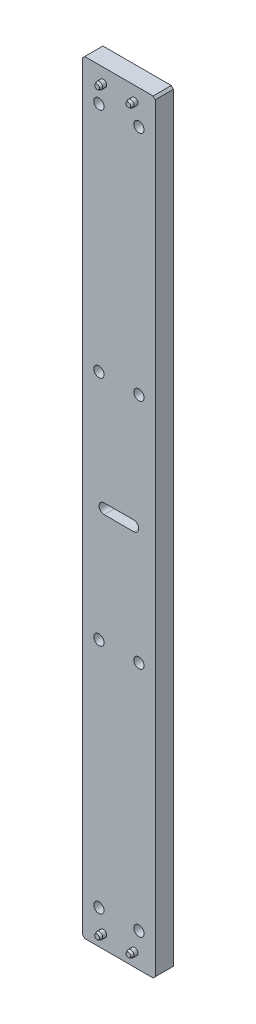
ISO-10303-21;
HEADER;
FILE_DESCRIPTION(('STEP AP214'),'2;1');
FILE_NAME('part.step','',(''),(''),'','','');
FILE_SCHEMA(('AUTOMOTIVE_DESIGN { 1 0 10303 214 1 1 1 1 }'));
ENDSEC;
DATA;
#1=APPLICATION_CONTEXT('core data for automotive mechanical design processes');
#2=APPLICATION_PROTOCOL_DEFINITION('international standard','automotive_design',2000,#1);
#3=PRODUCT_CONTEXT('',#1,'mechanical');
#4=PRODUCT('Part','Part','',(#3));
#5=PRODUCT_RELATED_PRODUCT_CATEGORY('part','',(#4));
#6=PRODUCT_DEFINITION_FORMATION('','',#4);
#7=PRODUCT_DEFINITION_CONTEXT('part definition',#1,'design');
#8=PRODUCT_DEFINITION('design','',#6,#7);
#9=PRODUCT_DEFINITION_SHAPE('','',#8);
#10=(LENGTH_UNIT() NAMED_UNIT(*) SI_UNIT(.MILLI.,.METRE.));
#11=(NAMED_UNIT(*) PLANE_ANGLE_UNIT() SI_UNIT($,.RADIAN.));
#12=(NAMED_UNIT(*) SI_UNIT($,.STERADIAN.) SOLID_ANGLE_UNIT());
#13=UNCERTAINTY_MEASURE_WITH_UNIT(LENGTH_MEASURE(1.E-05),#10,'distance_accuracy_value','');
#14=(GEOMETRIC_REPRESENTATION_CONTEXT(3) GLOBAL_UNCERTAINTY_ASSIGNED_CONTEXT((#13)) GLOBAL_UNIT_ASSIGNED_CONTEXT((#10,
#11,#12)) REPRESENTATION_CONTEXT('',''));
#15=CARTESIAN_POINT('',(0.,0.,0.));
#16=DIRECTION('',(0.,0.,1.));
#17=DIRECTION('',(1.,0.,0.));
#18=AXIS2_PLACEMENT_3D('',#15,#16,#17);
#19=CARTESIAN_POINT('',(10.922,-257.048,-5.20700000000002));
#20=DIRECTION('',(0.,0.,1.));
#21=DIRECTION('',(-1.,0.,0.));
#22=AXIS2_PLACEMENT_3D('',#19,#20,#21);
#23=PLANE('',#22);
#24=CARTESIAN_POINT('',(10.922,-257.048,-5.20700000000002));
#25=DIRECTION('',(0.,0.,1.));
#26=DIRECTION('',(-1.,0.,0.));
#27=AXIS2_PLACEMENT_3D('',#24,#25,#26);
#28=CIRCLE('',#27,2.1209);
#29=CARTESIAN_POINT('',(8.80109999999999,-257.048,-5.20700000000002));
#30=VERTEX_POINT('',#29);
#31=EDGE_CURVE('E57',#30,#30,#28,.T.);
#32=ORIENTED_EDGE('',*,*,#31,.F.);
#33=EDGE_LOOP('',(#32));
#34=FACE_BOUND('',#33,.T.);
#35=ADVANCED_FACE('F43',(#34),#23,.F.);
#36=CARTESIAN_POINT('',(10.922,-257.048,10.668));
#37=DIRECTION('',(0.,0.,-1.));
#38=DIRECTION('',(1.,0.,0.));
#39=AXIS2_PLACEMENT_3D('',#36,#37,#38);
#40=PLANE('',#39);
#41=CARTESIAN_POINT('',(10.922,-257.048,10.668));
#42=DIRECTION('',(0.,0.,1.));
#43=DIRECTION('',(-1.,0.,0.));
#44=AXIS2_PLACEMENT_3D('',#41,#42,#43);
#45=CIRCLE('',#44,1.64944869993752);
#46=CARTESIAN_POINT('',(9.27255130006246,-257.048,10.668));
#47=VERTEX_POINT('',#46);
#48=EDGE_CURVE('E11',#47,#47,#45,.T.);
#49=ORIENTED_EDGE('',*,*,#48,.T.);
#50=EDGE_LOOP('',(#49));
#51=FACE_BOUND('',#50,.T.);
#52=ADVANCED_FACE('F66',(#51),#40,.F.);
#53=CARTESIAN_POINT('',(10.922,-257.048,9.0932));
#54=DIRECTION('',(0.,0.,-1.));
#55=DIRECTION('',(1.,0.,0.));
#56=AXIS2_PLACEMENT_3D('',#53,#54,#55);
#57=CONICAL_SURFACE('',#56,2.38379,0.436332312998575);
#58=ORIENTED_EDGE('',*,*,#48,.F.);
#59=EDGE_LOOP('',(#58));
#60=FACE_BOUND('',#59,.T.);
#61=CARTESIAN_POINT('',(10.922,-257.048,9.0932));
#62=DIRECTION('',(0.,0.,1.));
#63=DIRECTION('',(-1.,0.,0.));
#64=AXIS2_PLACEMENT_3D('',#61,#62,#63);
#65=CIRCLE('',#64,2.38379);
#66=CARTESIAN_POINT('',(8.53820999999999,-257.048,9.0932));
#67=VERTEX_POINT('',#66);
#68=EDGE_CURVE('E49',#67,#67,#65,.T.);
#69=ORIENTED_EDGE('',*,*,#68,.T.);
#70=EDGE_LOOP('',(#69));
#71=FACE_BOUND('',#70,.T.);
#72=ADVANCED_FACE('F70',(#60,#71),#57,.T.);
#73=CARTESIAN_POINT('',(10.922,-257.048,-5.20700000000002));
#74=DIRECTION('',(0.,0.,1.));
#75=DIRECTION('',(-1.,0.,0.));
#76=AXIS2_PLACEMENT_3D('',#73,#74,#75);
#77=CYLINDRICAL_SURFACE('',#76,2.38379);
#78=ORIENTED_EDGE('',*,*,#68,.F.);
#79=EDGE_LOOP('',(#78));
#80=FACE_BOUND('',#79,.T.);
#81=CARTESIAN_POINT('',(10.922,-257.048,-1.44749784777304));
#82=DIRECTION('',(0.,0.,1.));
#83=DIRECTION('',(-1.,0.,0.));
#84=AXIS2_PLACEMENT_3D('',#81,#82,#83);
#85=CIRCLE('',#84,2.38379);
#86=CARTESIAN_POINT('',(8.53820999999999,-257.048,-1.44749784777304));
#87=VERTEX_POINT('',#86);
#88=EDGE_CURVE('E53',#87,#87,#85,.T.);
#89=ORIENTED_EDGE('',*,*,#88,.T.);
#90=EDGE_LOOP('',(#89));
#91=FACE_BOUND('',#90,.T.);
#92=ADVANCED_FACE('F74',(#80,#91),#77,.T.);
#93=CARTESIAN_POINT('',(10.922,-257.048,-5.20700000000002));
#94=DIRECTION('',(0.,0.,1.));
#95=DIRECTION('',(-1.,0.,0.));
#96=AXIS2_PLACEMENT_3D('',#93,#94,#95);
#97=CONICAL_SURFACE('',#96,2.1209,0.0698131700797735);
#98=ORIENTED_EDGE('',*,*,#88,.F.);
#99=EDGE_LOOP('',(#98));
#100=FACE_BOUND('',#99,.T.);
#101=ORIENTED_EDGE('',*,*,#31,.T.);
#102=EDGE_LOOP('',(#101));
#103=FACE_BOUND('',#102,.T.);
#104=ADVANCED_FACE('F63',(#100,#103),#97,.T.);
#105=CLOSED_SHELL('',(#35,#52,#72,#92,#104));
#106=MANIFOLD_SOLID_BREP('B2',#105);
#107=CARTESIAN_POINT('',(-10.9219999999999,-257.048,-5.20700000000005));
#108=DIRECTION('',(0.,0.,1.));
#109=DIRECTION('',(-1.,0.,0.));
#110=AXIS2_PLACEMENT_3D('',#107,#108,#109);
#111=PLANE('',#110);
#112=CARTESIAN_POINT('',(-10.9219999999999,-257.048,-5.20700000000005));
#113=DIRECTION('',(0.,0.,1.));
#114=DIRECTION('',(-1.,0.,0.));
#115=AXIS2_PLACEMENT_3D('',#112,#113,#114);
#116=CIRCLE('',#115,2.1209);
#117=CARTESIAN_POINT('',(-13.0428999999999,-257.048,-5.20700000000005));
#118=VERTEX_POINT('',#117);
#119=EDGE_CURVE('E135',#118,#118,#116,.T.);
#120=ORIENTED_EDGE('',*,*,#119,.F.);
#121=EDGE_LOOP('',(#120));
#122=FACE_BOUND('',#121,.T.);
#123=ADVANCED_FACE('F121',(#122),#111,.F.);
#124=CARTESIAN_POINT('',(-10.9219999999999,-257.048,10.668));
#125=DIRECTION('',(0.,0.,-1.));
#126=DIRECTION('',(1.,0.,0.));
#127=AXIS2_PLACEMENT_3D('',#124,#125,#126);
#128=PLANE('',#127);
#129=CARTESIAN_POINT('',(-10.9219999999999,-257.048,10.668));
#130=DIRECTION('',(0.,0.,1.));
#131=DIRECTION('',(-1.,0.,0.));
#132=AXIS2_PLACEMENT_3D('',#129,#130,#131);
#133=CIRCLE('',#132,1.64944869993752);
#134=CARTESIAN_POINT('',(-12.5714486999374,-257.048,10.668));
#135=VERTEX_POINT('',#134);
#136=EDGE_CURVE('E42',#135,#135,#133,.T.);
#137=ORIENTED_EDGE('',*,*,#136,.T.);
#138=EDGE_LOOP('',(#137));
#139=FACE_BOUND('',#138,.T.);
#140=ADVANCED_FACE('F144',(#139),#128,.F.);
#141=CARTESIAN_POINT('',(-10.9219999999999,-257.048,9.09319999999997));
#142=DIRECTION('',(0.,0.,-1.));
#143=DIRECTION('',(1.,0.,0.));
#144=AXIS2_PLACEMENT_3D('',#141,#142,#143);
#145=CONICAL_SURFACE('',#144,2.38379,0.436332312998575);
#146=ORIENTED_EDGE('',*,*,#136,.F.);
#147=EDGE_LOOP('',(#146));
#148=FACE_BOUND('',#147,.T.);
#149=CARTESIAN_POINT('',(-10.9219999999999,-257.048,9.09319999999997));
#150=DIRECTION('',(0.,0.,1.));
#151=DIRECTION('',(-1.,0.,0.));
#152=AXIS2_PLACEMENT_3D('',#149,#150,#151);
#153=CIRCLE('',#152,2.38379);
#154=CARTESIAN_POINT('',(-13.3057899999999,-257.048,9.09319999999997));
#155=VERTEX_POINT('',#154);
#156=EDGE_CURVE('E127',#155,#155,#153,.T.);
#157=ORIENTED_EDGE('',*,*,#156,.T.);
#158=EDGE_LOOP('',(#157));
#159=FACE_BOUND('',#158,.T.);
#160=ADVANCED_FACE('F148',(#148,#159),#145,.T.);
#161=CARTESIAN_POINT('',(-10.9219999999999,-257.048,-5.20700000000005));
#162=DIRECTION('',(0.,0.,1.));
#163=DIRECTION('',(-1.,0.,0.));
#164=AXIS2_PLACEMENT_3D('',#161,#162,#163);
#165=CYLINDRICAL_SURFACE('',#164,2.38379);
#166=ORIENTED_EDGE('',*,*,#156,.F.);
#167=EDGE_LOOP('',(#166));
#168=FACE_BOUND('',#167,.T.);
#169=CARTESIAN_POINT('',(-10.9219999999999,-257.048,-1.44749784777307));
#170=DIRECTION('',(0.,0.,1.));
#171=DIRECTION('',(-1.,0.,0.));
#172=AXIS2_PLACEMENT_3D('',#169,#170,#171);
#173=CIRCLE('',#172,2.38379);
#174=CARTESIAN_POINT('',(-13.3057899999999,-257.048,-1.44749784777307));
#175=VERTEX_POINT('',#174);
#176=EDGE_CURVE('E131',#175,#175,#173,.T.);
#177=ORIENTED_EDGE('',*,*,#176,.T.);
#178=EDGE_LOOP('',(#177));
#179=FACE_BOUND('',#178,.T.);
#180=ADVANCED_FACE('F152',(#168,#179),#165,.T.);
#181=CARTESIAN_POINT('',(-10.9219999999999,-257.048,-5.20700000000005));
#182=DIRECTION('',(0.,0.,1.));
#183=DIRECTION('',(-1.,0.,0.));
#184=AXIS2_PLACEMENT_3D('',#181,#182,#183);
#185=CONICAL_SURFACE('',#184,2.1209,0.0698131700797735);
#186=ORIENTED_EDGE('',*,*,#176,.F.);
#187=EDGE_LOOP('',(#186));
#188=FACE_BOUND('',#187,.T.);
#189=ORIENTED_EDGE('',*,*,#119,.T.);
#190=EDGE_LOOP('',(#189));
#191=FACE_BOUND('',#190,.T.);
#192=ADVANCED_FACE('F141',(#188,#191),#185,.T.);
#193=CLOSED_SHELL('',(#123,#140,#160,#180,#192));
#194=MANIFOLD_SOLID_BREP('B6',#193);
#195=CARTESIAN_POINT('',(10.9219999999999,257.048,-5.20700000000002));
#196=DIRECTION('',(0.,0.,1.));
#197=DIRECTION('',(-1.,0.,0.));
#198=AXIS2_PLACEMENT_3D('',#195,#196,#197);
#199=PLANE('',#198);
#200=CARTESIAN_POINT('',(10.9219999999999,257.048,-5.20700000000002));
#201=DIRECTION('',(0.,0.,1.));
#202=DIRECTION('',(-1.,0.,0.));
#203=AXIS2_PLACEMENT_3D('',#200,#201,#202);
#204=CIRCLE('',#203,2.1209);
#205=CARTESIAN_POINT('',(8.80109999999987,257.048,-5.20700000000002));
#206=VERTEX_POINT('',#205);
#207=EDGE_CURVE('E213',#206,#206,#204,.T.);
#208=ORIENTED_EDGE('',*,*,#207,.F.);
#209=EDGE_LOOP('',(#208));
#210=FACE_BOUND('',#209,.T.);
#211=ADVANCED_FACE('F199',(#210),#199,.F.);
#212=CARTESIAN_POINT('',(10.9219999999999,257.048,10.668));
#213=DIRECTION('',(0.,0.,-1.));
#214=DIRECTION('',(1.,0.,0.));
#215=AXIS2_PLACEMENT_3D('',#212,#213,#214);
#216=PLANE('',#215);
#217=CARTESIAN_POINT('',(10.9219999999999,257.048,10.668));
#218=DIRECTION('',(0.,0.,1.));
#219=DIRECTION('',(-1.,0.,0.));
#220=AXIS2_PLACEMENT_3D('',#217,#218,#219);
#221=CIRCLE('',#220,1.64944869993752);
#222=CARTESIAN_POINT('',(9.27255130006235,257.048,10.668));
#223=VERTEX_POINT('',#222);
#224=EDGE_CURVE('E120',#223,#223,#221,.T.);
#225=ORIENTED_EDGE('',*,*,#224,.T.);
#226=EDGE_LOOP('',(#225));
#227=FACE_BOUND('',#226,.T.);
#228=ADVANCED_FACE('F222',(#227),#216,.F.);
#229=CARTESIAN_POINT('',(10.9219999999999,257.048,9.0932));
#230=DIRECTION('',(0.,0.,-1.));
#231=DIRECTION('',(1.,0.,0.));
#232=AXIS2_PLACEMENT_3D('',#229,#230,#231);
#233=CONICAL_SURFACE('',#232,2.38379,0.436332312998575);
#234=ORIENTED_EDGE('',*,*,#224,.F.);
#235=EDGE_LOOP('',(#234));
#236=FACE_BOUND('',#235,.T.);
#237=CARTESIAN_POINT('',(10.9219999999999,257.048,9.0932));
#238=DIRECTION('',(0.,0.,1.));
#239=DIRECTION('',(-1.,0.,0.));
#240=AXIS2_PLACEMENT_3D('',#237,#238,#239);
#241=CIRCLE('',#240,2.38379);
#242=CARTESIAN_POINT('',(8.53820999999988,257.048,9.0932));
#243=VERTEX_POINT('',#242);
#244=EDGE_CURVE('E205',#243,#243,#241,.T.);
#245=ORIENTED_EDGE('',*,*,#244,.T.);
#246=EDGE_LOOP('',(#245));
#247=FACE_BOUND('',#246,.T.);
#248=ADVANCED_FACE('F226',(#236,#247),#233,.T.);
#249=CARTESIAN_POINT('',(10.9219999999999,257.048,-5.20700000000002));
#250=DIRECTION('',(0.,0.,1.));
#251=DIRECTION('',(-1.,0.,0.));
#252=AXIS2_PLACEMENT_3D('',#249,#250,#251);
#253=CYLINDRICAL_SURFACE('',#252,2.38379);
#254=ORIENTED_EDGE('',*,*,#244,.F.);
#255=EDGE_LOOP('',(#254));
#256=FACE_BOUND('',#255,.T.);
#257=CARTESIAN_POINT('',(10.9219999999999,257.048,-1.44749784777304));
#258=DIRECTION('',(0.,0.,1.));
#259=DIRECTION('',(-1.,0.,0.));
#260=AXIS2_PLACEMENT_3D('',#257,#258,#259);
#261=CIRCLE('',#260,2.38379);
#262=CARTESIAN_POINT('',(8.53820999999987,257.048,-1.44749784777304));
#263=VERTEX_POINT('',#262);
#264=EDGE_CURVE('E209',#263,#263,#261,.T.);
#265=ORIENTED_EDGE('',*,*,#264,.T.);
#266=EDGE_LOOP('',(#265));
#267=FACE_BOUND('',#266,.T.);
#268=ADVANCED_FACE('F230',(#256,#267),#253,.T.);
#269=CARTESIAN_POINT('',(10.9219999999999,257.048,-5.20700000000002));
#270=DIRECTION('',(0.,0.,1.));
#271=DIRECTION('',(-1.,0.,0.));
#272=AXIS2_PLACEMENT_3D('',#269,#270,#271);
#273=CONICAL_SURFACE('',#272,2.1209,0.0698131700797735);
#274=ORIENTED_EDGE('',*,*,#264,.F.);
#275=EDGE_LOOP('',(#274));
#276=FACE_BOUND('',#275,.T.);
#277=ORIENTED_EDGE('',*,*,#207,.T.);
#278=EDGE_LOOP('',(#277));
#279=FACE_BOUND('',#278,.T.);
#280=ADVANCED_FACE('F219',(#276,#279),#273,.T.);
#281=CLOSED_SHELL('',(#211,#228,#248,#268,#280));
#282=MANIFOLD_SOLID_BREP('B37',#281);
#283=CARTESIAN_POINT('',(-10.922,257.048,-5.20700000000002));
#284=DIRECTION('',(0.,0.,1.));
#285=DIRECTION('',(-1.,0.,0.));
#286=AXIS2_PLACEMENT_3D('',#283,#284,#285);
#287=PLANE('',#286);
#288=CARTESIAN_POINT('',(-10.922,257.048,-5.20700000000002));
#289=DIRECTION('',(0.,0.,1.));
#290=DIRECTION('',(-1.,0.,0.));
#291=AXIS2_PLACEMENT_3D('',#288,#289,#290);
#292=CIRCLE('',#291,2.1209);
#293=CARTESIAN_POINT('',(-13.0429,257.048,-5.20700000000002));
#294=VERTEX_POINT('',#293);
#295=EDGE_CURVE('E292',#294,#294,#292,.T.);
#296=ORIENTED_EDGE('',*,*,#295,.F.);
#297=EDGE_LOOP('',(#296));
#298=FACE_BOUND('',#297,.T.);
#299=ADVANCED_FACE('F278',(#298),#287,.F.);
#300=CARTESIAN_POINT('',(-10.922,257.048,10.668));
#301=DIRECTION('',(0.,0.,-1.));
#302=DIRECTION('',(1.,0.,0.));
#303=AXIS2_PLACEMENT_3D('',#300,#301,#302);
#304=PLANE('',#303);
#305=CARTESIAN_POINT('',(-10.922,257.048,10.668));
#306=DIRECTION('',(0.,0.,1.));
#307=DIRECTION('',(-1.,0.,0.));
#308=AXIS2_PLACEMENT_3D('',#305,#306,#307);
#309=CIRCLE('',#308,1.64944869993752);
#310=CARTESIAN_POINT('',(-12.5714486999375,257.048,10.668));
#311=VERTEX_POINT('',#310);
#312=EDGE_CURVE('E198',#311,#311,#309,.T.);
#313=ORIENTED_EDGE('',*,*,#312,.T.);
#314=EDGE_LOOP('',(#313));
#315=FACE_BOUND('',#314,.T.);
#316=ADVANCED_FACE('F301',(#315),#304,.F.);
#317=CARTESIAN_POINT('',(-10.922,257.048,9.0932));
#318=DIRECTION('',(0.,0.,-1.));
#319=DIRECTION('',(1.,0.,0.));
#320=AXIS2_PLACEMENT_3D('',#317,#318,#319);
#321=CONICAL_SURFACE('',#320,2.38379,0.436332312998575);
#322=ORIENTED_EDGE('',*,*,#312,.F.);
#323=EDGE_LOOP('',(#322));
#324=FACE_BOUND('',#323,.T.);
#325=CARTESIAN_POINT('',(-10.922,257.048,9.0932));
#326=DIRECTION('',(0.,0.,1.));
#327=DIRECTION('',(-1.,0.,0.));
#328=AXIS2_PLACEMENT_3D('',#325,#326,#327);
#329=CIRCLE('',#328,2.38379);
#330=CARTESIAN_POINT('',(-13.30579,257.048,9.0932));
#331=VERTEX_POINT('',#330);
#332=EDGE_CURVE('E284',#331,#331,#329,.T.);
#333=ORIENTED_EDGE('',*,*,#332,.T.);
#334=EDGE_LOOP('',(#333));
#335=FACE_BOUND('',#334,.T.);
#336=ADVANCED_FACE('F305',(#324,#335),#321,.T.);
#337=CARTESIAN_POINT('',(-10.922,257.048,-5.20700000000002));
#338=DIRECTION('',(0.,0.,1.));
#339=DIRECTION('',(-1.,0.,0.));
#340=AXIS2_PLACEMENT_3D('',#337,#338,#339);
#341=CYLINDRICAL_SURFACE('',#340,2.38379);
#342=ORIENTED_EDGE('',*,*,#332,.F.);
#343=EDGE_LOOP('',(#342));
#344=FACE_BOUND('',#343,.T.);
#345=CARTESIAN_POINT('',(-10.922,257.048,-1.44749784777304));
#346=DIRECTION('',(0.,0.,1.));
#347=DIRECTION('',(-1.,0.,0.));
#348=AXIS2_PLACEMENT_3D('',#345,#346,#347);
#349=CIRCLE('',#348,2.38379);
#350=CARTESIAN_POINT('',(-13.30579,257.048,-1.44749784777304));
#351=VERTEX_POINT('',#350);
#352=EDGE_CURVE('E288',#351,#351,#349,.T.);
#353=ORIENTED_EDGE('',*,*,#352,.T.);
#354=EDGE_LOOP('',(#353));
#355=FACE_BOUND('',#354,.T.);
#356=ADVANCED_FACE('F309',(#344,#355),#341,.T.);
#357=CARTESIAN_POINT('',(-10.922,257.048,-5.20700000000002));
#358=DIRECTION('',(0.,0.,1.));
#359=DIRECTION('',(-1.,0.,0.));
#360=AXIS2_PLACEMENT_3D('',#357,#358,#359);
#361=CONICAL_SURFACE('',#360,2.1209,0.0698131700797735);
#362=ORIENTED_EDGE('',*,*,#352,.F.);
#363=EDGE_LOOP('',(#362));
#364=FACE_BOUND('',#363,.T.);
#365=ORIENTED_EDGE('',*,*,#295,.T.);
#366=EDGE_LOOP('',(#365));
#367=FACE_BOUND('',#366,.T.);
#368=ADVANCED_FACE('F298',(#364,#367),#361,.T.);
#369=CLOSED_SHELL('',(#299,#316,#336,#356,#368));
#370=MANIFOLD_SOLID_BREP('B115',#369);
#371=CARTESIAN_POINT('',(25.3999999999999,266.7,-6.35));
#372=DIRECTION('',(1.,0.,0.));
#373=DIRECTION('',(0.,0.,-1.));
#374=AXIS2_PLACEMENT_3D('',#371,#372,#373);
#375=PLANE('',#374);
#376=DIRECTION('',(0.,1.,0.));
#377=VECTOR('',#376,1.);
#378=CARTESIAN_POINT('',(25.3999999999999,266.7,6.35));
#379=LINE('',#378,#377);
#380=CARTESIAN_POINT('',(25.3999999999999,-265.176,6.35));
#381=VERTEX_POINT('',#380);
#382=CARTESIAN_POINT('',(25.3999999999999,265.176,6.35));
#383=VERTEX_POINT('',#382);
#384=EDGE_CURVE('E480',#381,#383,#379,.T.);
#385=ORIENTED_EDGE('',*,*,#384,.F.);
#386=DIRECTION('',(0.,0.,-1.));
#387=VECTOR('',#386,1.);
#388=CARTESIAN_POINT('',(25.3999999999999,-265.176,-6.35));
#389=LINE('',#388,#387);
#390=CARTESIAN_POINT('',(25.3999999999999,-265.176,-6.35));
#391=VERTEX_POINT('',#390);
#392=EDGE_CURVE('E534',#381,#391,#389,.T.);
#393=ORIENTED_EDGE('',*,*,#392,.T.);
#394=DIRECTION('',(0.,1.,0.));
#395=VECTOR('',#394,1.);
#396=CARTESIAN_POINT('',(25.3999999999999,266.7,-6.35));
#397=LINE('',#396,#395);
#398=CARTESIAN_POINT('',(25.3999999999999,265.176,-6.35));
#399=VERTEX_POINT('',#398);
#400=EDGE_CURVE('E484',#391,#399,#397,.T.);
#401=ORIENTED_EDGE('',*,*,#400,.T.);
#402=DIRECTION('',(0.,0.,1.));
#403=VECTOR('',#402,1.);
#404=CARTESIAN_POINT('',(25.3999999999999,265.176,-6.35));
#405=LINE('',#404,#403);
#406=EDGE_CURVE('E531',#399,#383,#405,.T.);
#407=ORIENTED_EDGE('',*,*,#406,.T.);
#408=EDGE_LOOP('',(#385,#393,#401,#407));
#409=FACE_BOUND('',#408,.T.);
#410=ADVANCED_FACE('F348',(#409),#375,.T.);
#411=CARTESIAN_POINT('',(25.3999999999999,-266.7,-6.35));
#412=DIRECTION('',(0.,-1.,0.));
#413=DIRECTION('',(0.,0.,-1.));
#414=AXIS2_PLACEMENT_3D('',#411,#412,#413);
#415=PLANE('',#414);
#416=DIRECTION('',(1.,0.,0.));
#417=VECTOR('',#416,1.);
#418=CARTESIAN_POINT('',(25.3999999999999,-266.7,6.35));
#419=LINE('',#418,#417);
#420=CARTESIAN_POINT('',(-23.8759999999998,-266.7,6.35));
#421=VERTEX_POINT('',#420);
#422=CARTESIAN_POINT('',(23.8759999999998,-266.7,6.35));
#423=VERTEX_POINT('',#422);
#424=EDGE_CURVE('E488',#421,#423,#419,.T.);
#425=ORIENTED_EDGE('',*,*,#424,.F.);
#426=DIRECTION('',(0.,0.,-1.));
#427=VECTOR('',#426,1.);
#428=CARTESIAN_POINT('',(-23.8759999999998,-266.7,-6.35));
#429=LINE('',#428,#427);
#430=CARTESIAN_POINT('',(-23.8759999999997,-266.7,-6.35));
#431=VERTEX_POINT('',#430);
#432=EDGE_CURVE('E522',#421,#431,#429,.T.);
#433=ORIENTED_EDGE('',*,*,#432,.T.);
#434=DIRECTION('',(1.,0.,0.));
#435=VECTOR('',#434,1.);
#436=CARTESIAN_POINT('',(25.3999999999999,-266.7,-6.35));
#437=LINE('',#436,#435);
#438=CARTESIAN_POINT('',(23.8759999999998,-266.7,-6.35));
#439=VERTEX_POINT('',#438);
#440=EDGE_CURVE('E493',#431,#439,#437,.T.);
#441=ORIENTED_EDGE('',*,*,#440,.T.);
#442=DIRECTION('',(0.,0.,1.));
#443=VECTOR('',#442,1.);
#444=CARTESIAN_POINT('',(23.8759999999998,-266.7,-6.35));
#445=LINE('',#444,#443);
#446=EDGE_CURVE('E519',#439,#423,#445,.T.);
#447=ORIENTED_EDGE('',*,*,#446,.T.);
#448=EDGE_LOOP('',(#425,#433,#441,#447));
#449=FACE_BOUND('',#448,.T.);
#450=ADVANCED_FACE('F548',(#449),#415,.T.);
#451=CARTESIAN_POINT('',(-25.4,266.7,-6.35));
#452=DIRECTION('',(-1.,0.,0.));
#453=DIRECTION('',(0.,0.,1.));
#454=AXIS2_PLACEMENT_3D('',#451,#452,#453);
#455=PLANE('',#454);
#456=DIRECTION('',(0.,-1.,0.));
#457=VECTOR('',#456,1.);
#458=CARTESIAN_POINT('',(-25.4,266.7,-6.35));
#459=LINE('',#458,#457);
#460=CARTESIAN_POINT('',(-25.3999999999999,265.176,-6.35));
#461=VERTEX_POINT('',#460);
#462=CARTESIAN_POINT('',(-25.4,-265.176,-6.35));
#463=VERTEX_POINT('',#462);
#464=EDGE_CURVE('E490',#461,#463,#459,.T.);
#465=ORIENTED_EDGE('',*,*,#464,.T.);
#466=DIRECTION('',(0.,0.,1.));
#467=VECTOR('',#466,1.);
#468=CARTESIAN_POINT('',(-25.4,-265.176,-6.35));
#469=LINE('',#468,#467);
#470=CARTESIAN_POINT('',(-25.4,-265.176,6.35));
#471=VERTEX_POINT('',#470);
#472=EDGE_CURVE('E508',#463,#471,#469,.T.);
#473=ORIENTED_EDGE('',*,*,#472,.T.);
#474=DIRECTION('',(0.,-1.,0.));
#475=VECTOR('',#474,1.);
#476=CARTESIAN_POINT('',(-25.4,266.7,6.35));
#477=LINE('',#476,#475);
#478=CARTESIAN_POINT('',(-25.4,265.176,6.35));
#479=VERTEX_POINT('',#478);
#480=EDGE_CURVE('E502',#479,#471,#477,.T.);
#481=ORIENTED_EDGE('',*,*,#480,.F.);
#482=DIRECTION('',(0.,0.,-1.));
#483=VECTOR('',#482,1.);
#484=CARTESIAN_POINT('',(-25.4,265.176,-6.35));
#485=LINE('',#484,#483);
#486=EDGE_CURVE('E496',#479,#461,#485,.T.);
#487=ORIENTED_EDGE('',*,*,#486,.T.);
#488=EDGE_LOOP('',(#465,#473,#481,#487));
#489=FACE_BOUND('',#488,.T.);
#490=ADVANCED_FACE('F558',(#489),#455,.T.);
#491=CARTESIAN_POINT('',(25.3999999999999,266.7,-6.35));
#492=DIRECTION('',(0.,1.,0.));
#493=DIRECTION('',(0.,0.,1.));
#494=AXIS2_PLACEMENT_3D('',#491,#492,#493);
#495=PLANE('',#494);
#496=DIRECTION('',(-1.,0.,0.));
#497=VECTOR('',#496,1.);
#498=CARTESIAN_POINT('',(25.3999999999999,266.7,-6.35));
#499=LINE('',#498,#497);
#500=CARTESIAN_POINT('',(23.8759999999997,266.7,-6.35));
#501=VERTEX_POINT('',#500);
#502=CARTESIAN_POINT('',(-23.8759999999999,266.7,-6.35));
#503=VERTEX_POINT('',#502);
#504=EDGE_CURVE('E487',#501,#503,#499,.T.);
#505=ORIENTED_EDGE('',*,*,#504,.T.);
#506=DIRECTION('',(0.,0.,1.));
#507=VECTOR('',#506,1.);
#508=CARTESIAN_POINT('',(-23.876,266.7,-6.35));
#509=LINE('',#508,#507);
#510=CARTESIAN_POINT('',(-23.876,266.7,6.35));
#511=VERTEX_POINT('',#510);
#512=EDGE_CURVE('E276',#503,#511,#509,.T.);
#513=ORIENTED_EDGE('',*,*,#512,.T.);
#514=DIRECTION('',(-1.,0.,0.));
#515=VECTOR('',#514,1.);
#516=CARTESIAN_POINT('',(25.3999999999999,266.7,6.35));
#517=LINE('',#516,#515);
#518=CARTESIAN_POINT('',(23.8759999999998,266.7,6.35));
#519=VERTEX_POINT('',#518);
#520=EDGE_CURVE('E499',#519,#511,#517,.T.);
#521=ORIENTED_EDGE('',*,*,#520,.F.);
#522=DIRECTION('',(0.,0.,-1.));
#523=VECTOR('',#522,1.);
#524=CARTESIAN_POINT('',(23.8759999999998,266.7,-6.35));
#525=LINE('',#524,#523);
#526=EDGE_CURVE('E356',#519,#501,#525,.T.);
#527=ORIENTED_EDGE('',*,*,#526,.T.);
#528=EDGE_LOOP('',(#505,#513,#521,#527));
#529=FACE_BOUND('',#528,.T.);
#530=ADVANCED_FACE('F563',(#529),#495,.T.);
#531=CARTESIAN_POINT('',(0.,0.,-6.35));
#532=DIRECTION('',(0.,0.,-1.));
#533=DIRECTION('',(-1.,0.,0.));
#534=AXIS2_PLACEMENT_3D('',#531,#532,#533);
#535=PLANE('',#534);
#536=CARTESIAN_POINT('',(13.97,243.078,-6.35));
#537=DIRECTION('',(0.,0.,1.));
#538=DIRECTION('',(1.,0.,0.));
#539=AXIS2_PLACEMENT_3D('',#536,#537,#538);
#540=CIRCLE('',#539,3.57124);
#541=CARTESIAN_POINT('',(17.54124,243.078,-6.35));
#542=VERTEX_POINT('',#541);
#543=EDGE_CURVE('E804',#542,#542,#540,.T.);
#544=ORIENTED_EDGE('',*,*,#543,.T.);
#545=EDGE_LOOP('',(#544));
#546=FACE_BOUND('',#545,.T.);
#547=CARTESIAN_POINT('',(13.97,81.026,-6.35));
#548=DIRECTION('',(0.,0.,1.));
#549=DIRECTION('',(1.,0.,0.));
#550=AXIS2_PLACEMENT_3D('',#547,#548,#549);
#551=CIRCLE('',#550,3.57124);
#552=CARTESIAN_POINT('',(17.54124,81.026,-6.35));
#553=VERTEX_POINT('',#552);
#554=EDGE_CURVE('E808',#553,#553,#551,.T.);
#555=ORIENTED_EDGE('',*,*,#554,.T.);
#556=EDGE_LOOP('',(#555));
#557=FACE_BOUND('',#556,.T.);
#558=CARTESIAN_POINT('',(13.97,-81.026,-6.35));
#559=DIRECTION('',(0.,0.,1.));
#560=DIRECTION('',(1.,0.,0.));
#561=AXIS2_PLACEMENT_3D('',#558,#559,#560);
#562=CIRCLE('',#561,3.57124);
#563=CARTESIAN_POINT('',(17.54124,-81.026,-6.35));
#564=VERTEX_POINT('',#563);
#565=EDGE_CURVE('E812',#564,#564,#562,.T.);
#566=ORIENTED_EDGE('',*,*,#565,.T.);
#567=EDGE_LOOP('',(#566));
#568=FACE_BOUND('',#567,.T.);
#569=CARTESIAN_POINT('',(13.97,-243.078,-6.35));
#570=DIRECTION('',(0.,0.,1.));
#571=DIRECTION('',(1.,0.,0.));
#572=AXIS2_PLACEMENT_3D('',#569,#570,#571);
#573=CIRCLE('',#572,3.57124);
#574=CARTESIAN_POINT('',(17.54124,-243.078,-6.35));
#575=VERTEX_POINT('',#574);
#576=EDGE_CURVE('E816',#575,#575,#573,.T.);
#577=ORIENTED_EDGE('',*,*,#576,.T.);
#578=EDGE_LOOP('',(#577));
#579=FACE_BOUND('',#578,.T.);
#580=CARTESIAN_POINT('',(-13.97,-243.078,-6.35));
#581=DIRECTION('',(0.,0.,1.));
#582=DIRECTION('',(1.,0.,0.));
#583=AXIS2_PLACEMENT_3D('',#580,#581,#582);
#584=CIRCLE('',#583,3.57124);
#585=CARTESIAN_POINT('',(-10.39876,-243.078,-6.35));
#586=VERTEX_POINT('',#585);
#587=EDGE_CURVE('E820',#586,#586,#584,.T.);
#588=ORIENTED_EDGE('',*,*,#587,.T.);
#589=EDGE_LOOP('',(#588));
#590=FACE_BOUND('',#589,.T.);
#591=CARTESIAN_POINT('',(-13.97,-81.026,-6.35));
#592=DIRECTION('',(0.,0.,1.));
#593=DIRECTION('',(1.,0.,0.));
#594=AXIS2_PLACEMENT_3D('',#591,#592,#593);
#595=CIRCLE('',#594,3.57124);
#596=CARTESIAN_POINT('',(-10.39876,-81.026,-6.35));
#597=VERTEX_POINT('',#596);
#598=EDGE_CURVE('E824',#597,#597,#595,.T.);
#599=ORIENTED_EDGE('',*,*,#598,.T.);
#600=EDGE_LOOP('',(#599));
#601=FACE_BOUND('',#600,.T.);
#602=CARTESIAN_POINT('',(-13.97,81.026,-6.35));
#603=DIRECTION('',(0.,0.,1.));
#604=DIRECTION('',(1.,0.,0.));
#605=AXIS2_PLACEMENT_3D('',#602,#603,#604);
#606=CIRCLE('',#605,3.57124);
#607=CARTESIAN_POINT('',(-10.39876,81.026,-6.35));
#608=VERTEX_POINT('',#607);
#609=EDGE_CURVE('E828',#608,#608,#606,.T.);
#610=ORIENTED_EDGE('',*,*,#609,.T.);
#611=EDGE_LOOP('',(#610));
#612=FACE_BOUND('',#611,.T.);
#613=CARTESIAN_POINT('',(-13.97,243.078,-6.35));
#614=DIRECTION('',(0.,0.,1.));
#615=DIRECTION('',(1.,0.,0.));
#616=AXIS2_PLACEMENT_3D('',#613,#614,#615);
#617=CIRCLE('',#616,3.57124);
#618=CARTESIAN_POINT('',(-10.39876,243.078,-6.35));
#619=VERTEX_POINT('',#618);
#620=EDGE_CURVE('E832',#619,#619,#617,.T.);
#621=ORIENTED_EDGE('',*,*,#620,.T.);
#622=EDGE_LOOP('',(#621));
#623=FACE_BOUND('',#622,.T.);
#624=CARTESIAN_POINT('',(10.9219999999999,257.048,-6.35));
#625=DIRECTION('',(0.,0.,1.));
#626=DIRECTION('',(1.,0.,0.));
#627=AXIS2_PLACEMENT_3D('',#624,#625,#626);
#628=CIRCLE('',#627,2.4003);
#629=CARTESIAN_POINT('',(13.3222999999999,257.048,-6.35));
#630=VERTEX_POINT('',#629);
#631=EDGE_CURVE('E836',#630,#630,#628,.T.);
#632=ORIENTED_EDGE('',*,*,#631,.T.);
#633=EDGE_LOOP('',(#632));
#634=FACE_BOUND('',#633,.T.);
#635=CARTESIAN_POINT('',(10.922,-257.048,-6.35));
#636=DIRECTION('',(0.,0.,1.));
#637=DIRECTION('',(1.,0.,0.));
#638=AXIS2_PLACEMENT_3D('',#635,#636,#637);
#639=CIRCLE('',#638,2.4003);
#640=CARTESIAN_POINT('',(13.3223,-257.048,-6.35));
#641=VERTEX_POINT('',#640);
#642=EDGE_CURVE('E840',#641,#641,#639,.T.);
#643=ORIENTED_EDGE('',*,*,#642,.T.);
#644=EDGE_LOOP('',(#643));
#645=FACE_BOUND('',#644,.T.);
#646=CARTESIAN_POINT('',(-10.922,257.048,-6.35));
#647=DIRECTION('',(0.,0.,1.));
#648=DIRECTION('',(1.,0.,0.));
#649=AXIS2_PLACEMENT_3D('',#646,#647,#648);
#650=CIRCLE('',#649,2.4003);
#651=CARTESIAN_POINT('',(-8.52169999999999,257.048,-6.35));
#652=VERTEX_POINT('',#651);
#653=EDGE_CURVE('E844',#652,#652,#650,.T.);
#654=ORIENTED_EDGE('',*,*,#653,.T.);
#655=EDGE_LOOP('',(#654));
#656=FACE_BOUND('',#655,.T.);
#657=CARTESIAN_POINT('',(-10.9219999999999,-257.048,-6.35));
#658=DIRECTION('',(0.,0.,1.));
#659=DIRECTION('',(1.,0.,0.));
#660=AXIS2_PLACEMENT_3D('',#657,#658,#659);
#661=CIRCLE('',#660,2.4003);
#662=CARTESIAN_POINT('',(-8.52169999999988,-257.048,-6.35));
#663=VERTEX_POINT('',#662);
#664=EDGE_CURVE('E468',#663,#663,#661,.T.);
#665=ORIENTED_EDGE('',*,*,#664,.T.);
#666=EDGE_LOOP('',(#665));
#667=FACE_BOUND('',#666,.T.);
#668=CARTESIAN_POINT('',(10.287,0.,-6.35));
#669=DIRECTION('',(0.,0.,1.));
#670=DIRECTION('',(1.,0.,0.));
#671=AXIS2_PLACEMENT_3D('',#668,#669,#670);
#672=CIRCLE('',#671,3.5687);
#673=CARTESIAN_POINT('',(10.287,-3.5687,-6.35));
#674=VERTEX_POINT('',#673);
#675=CARTESIAN_POINT('',(10.287,3.56870000000001,-6.35));
#676=VERTEX_POINT('',#675);
#677=EDGE_CURVE('E442',#674,#676,#672,.T.);
#678=ORIENTED_EDGE('',*,*,#677,.T.);
#679=DIRECTION('',(-1.,0.,0.));
#680=VECTOR('',#679,1.);
#681=CARTESIAN_POINT('',(10.287,3.56870000000001,-6.35));
#682=LINE('',#681,#680);
#683=CARTESIAN_POINT('',(-10.287,3.5687,-6.35));
#684=VERTEX_POINT('',#683);
#685=EDGE_CURVE('E454',#676,#684,#682,.T.);
#686=ORIENTED_EDGE('',*,*,#685,.T.);
#687=CARTESIAN_POINT('',(-10.287,0.,-6.35));
#688=DIRECTION('',(0.,0.,1.));
#689=DIRECTION('',(1.,0.,0.));
#690=AXIS2_PLACEMENT_3D('',#687,#688,#689);
#691=CIRCLE('',#690,3.5687);
#692=CARTESIAN_POINT('',(-10.287,-3.5687,-6.35));
#693=VERTEX_POINT('',#692);
#694=EDGE_CURVE('E458',#684,#693,#691,.T.);
#695=ORIENTED_EDGE('',*,*,#694,.T.);
#696=DIRECTION('',(1.,0.,0.));
#697=VECTOR('',#696,1.);
#698=CARTESIAN_POINT('',(10.287,-3.5687,-6.35));
#699=LINE('',#698,#697);
#700=EDGE_CURVE('E450',#693,#674,#699,.T.);
#701=ORIENTED_EDGE('',*,*,#700,.T.);
#702=EDGE_LOOP('',(#678,#686,#695,#701));
#703=FACE_BOUND('',#702,.T.);
#704=ORIENTED_EDGE('',*,*,#440,.F.);
#705=DIRECTION('',(0.70710678118656,-0.707106781186535,0.));
#706=VECTOR('',#705,1.);
#707=CARTESIAN_POINT('',(-145.287999999999,-145.288000000005,-6.35));
#708=LINE('',#707,#706);
#709=EDGE_CURVE('E529',#431,#463,#708,.F.);
#710=ORIENTED_EDGE('',*,*,#709,.T.);
#711=ORIENTED_EDGE('',*,*,#464,.F.);
#712=DIRECTION('',(-0.707106781186548,-0.707106781186548,0.));
#713=VECTOR('',#712,1.);
#714=CARTESIAN_POINT('',(-145.288,145.288,-6.35));
#715=LINE('',#714,#713);
#716=EDGE_CURVE('E363',#461,#503,#715,.F.);
#717=ORIENTED_EDGE('',*,*,#716,.T.);
#718=ORIENTED_EDGE('',*,*,#504,.F.);
#719=DIRECTION('',(-0.70710678118656,0.707106781186535,0.));
#720=VECTOR('',#719,1.);
#721=CARTESIAN_POINT('',(145.287999999999,145.288000000005,-6.35));
#722=LINE('',#721,#720);
#723=EDGE_CURVE('E524',#501,#399,#722,.F.);
#724=ORIENTED_EDGE('',*,*,#723,.T.);
#725=ORIENTED_EDGE('',*,*,#400,.F.);
#726=DIRECTION('',(0.707106781186573,0.707106781186522,0.));
#727=VECTOR('',#726,1.);
#728=CARTESIAN_POINT('',(145.287999999999,-145.28800000001,-6.35));
#729=LINE('',#728,#727);
#730=EDGE_CURVE('E527',#391,#439,#729,.F.);
#731=ORIENTED_EDGE('',*,*,#730,.T.);
#732=EDGE_LOOP('',(#704,#710,#711,#717,#718,#724,#725,#731));
#733=FACE_BOUND('',#732,.T.);
#734=ADVANCED_FACE('F460',(#546,#557,#568,#579,#590,#601,#612,#623,#634,#645,#656,#667,#703,
#733),#535,.T.);
#735=CARTESIAN_POINT('',(0.,0.,6.35));
#736=DIRECTION('',(0.,0.,-1.));
#737=DIRECTION('',(-1.,0.,0.));
#738=AXIS2_PLACEMENT_3D('',#735,#736,#737);
#739=PLANE('',#738);
#740=CARTESIAN_POINT('',(13.97,243.078,6.35));
#741=DIRECTION('',(0.,0.,1.));
#742=DIRECTION('',(1.,0.,0.));
#743=AXIS2_PLACEMENT_3D('',#740,#741,#742);
#744=CIRCLE('',#743,3.57124);
#745=CARTESIAN_POINT('',(17.54124,243.078,6.35));
#746=VERTEX_POINT('',#745);
#747=EDGE_CURVE('E893',#746,#746,#744,.T.);
#748=ORIENTED_EDGE('',*,*,#747,.F.);
#749=EDGE_LOOP('',(#748));
#750=FACE_BOUND('',#749,.T.);
#751=CARTESIAN_POINT('',(13.97,81.026,6.35));
#752=DIRECTION('',(0.,0.,1.));
#753=DIRECTION('',(1.,0.,0.));
#754=AXIS2_PLACEMENT_3D('',#751,#752,#753);
#755=CIRCLE('',#754,3.57124);
#756=CARTESIAN_POINT('',(17.54124,81.026,6.35));
#757=VERTEX_POINT('',#756);
#758=EDGE_CURVE('E889',#757,#757,#755,.T.);
#759=ORIENTED_EDGE('',*,*,#758,.F.);
#760=EDGE_LOOP('',(#759));
#761=FACE_BOUND('',#760,.T.);
#762=CARTESIAN_POINT('',(13.97,-81.026,6.35));
#763=DIRECTION('',(0.,0.,1.));
#764=DIRECTION('',(1.,0.,0.));
#765=AXIS2_PLACEMENT_3D('',#762,#763,#764);
#766=CIRCLE('',#765,3.57124);
#767=CARTESIAN_POINT('',(17.54124,-81.026,6.35));
#768=VERTEX_POINT('',#767);
#769=EDGE_CURVE('E885',#768,#768,#766,.T.);
#770=ORIENTED_EDGE('',*,*,#769,.F.);
#771=EDGE_LOOP('',(#770));
#772=FACE_BOUND('',#771,.T.);
#773=CARTESIAN_POINT('',(13.97,-243.078,6.35));
#774=DIRECTION('',(0.,0.,1.));
#775=DIRECTION('',(1.,0.,0.));
#776=AXIS2_PLACEMENT_3D('',#773,#774,#775);
#777=CIRCLE('',#776,3.57124);
#778=CARTESIAN_POINT('',(17.54124,-243.078,6.35));
#779=VERTEX_POINT('',#778);
#780=EDGE_CURVE('E881',#779,#779,#777,.T.);
#781=ORIENTED_EDGE('',*,*,#780,.F.);
#782=EDGE_LOOP('',(#781));
#783=FACE_BOUND('',#782,.T.);
#784=CARTESIAN_POINT('',(-13.97,-243.078,6.35));
#785=DIRECTION('',(0.,0.,1.));
#786=DIRECTION('',(1.,0.,0.));
#787=AXIS2_PLACEMENT_3D('',#784,#785,#786);
#788=CIRCLE('',#787,3.57124);
#789=CARTESIAN_POINT('',(-10.39876,-243.078,6.35));
#790=VERTEX_POINT('',#789);
#791=EDGE_CURVE('E877',#790,#790,#788,.T.);
#792=ORIENTED_EDGE('',*,*,#791,.F.);
#793=EDGE_LOOP('',(#792));
#794=FACE_BOUND('',#793,.T.);
#795=CARTESIAN_POINT('',(-13.97,-81.026,6.35));
#796=DIRECTION('',(0.,0.,1.));
#797=DIRECTION('',(1.,0.,0.));
#798=AXIS2_PLACEMENT_3D('',#795,#796,#797);
#799=CIRCLE('',#798,3.57124);
#800=CARTESIAN_POINT('',(-10.39876,-81.026,6.35));
#801=VERTEX_POINT('',#800);
#802=EDGE_CURVE('E873',#801,#801,#799,.T.);
#803=ORIENTED_EDGE('',*,*,#802,.F.);
#804=EDGE_LOOP('',(#803));
#805=FACE_BOUND('',#804,.T.);
#806=CARTESIAN_POINT('',(-13.97,81.026,6.35));
#807=DIRECTION('',(0.,0.,1.));
#808=DIRECTION('',(1.,0.,0.));
#809=AXIS2_PLACEMENT_3D('',#806,#807,#808);
#810=CIRCLE('',#809,3.57124);
#811=CARTESIAN_POINT('',(-10.39876,81.026,6.35));
#812=VERTEX_POINT('',#811);
#813=EDGE_CURVE('E869',#812,#812,#810,.T.);
#814=ORIENTED_EDGE('',*,*,#813,.F.);
#815=EDGE_LOOP('',(#814));
#816=FACE_BOUND('',#815,.T.);
#817=CARTESIAN_POINT('',(-13.97,243.078,6.35));
#818=DIRECTION('',(0.,0.,1.));
#819=DIRECTION('',(1.,0.,0.));
#820=AXIS2_PLACEMENT_3D('',#817,#818,#819);
#821=CIRCLE('',#820,3.57124);
#822=CARTESIAN_POINT('',(-10.39876,243.078,6.35));
#823=VERTEX_POINT('',#822);
#824=EDGE_CURVE('E865',#823,#823,#821,.T.);
#825=ORIENTED_EDGE('',*,*,#824,.F.);
#826=EDGE_LOOP('',(#825));
#827=FACE_BOUND('',#826,.T.);
#828=CARTESIAN_POINT('',(10.9219999999999,257.048,6.35));
#829=DIRECTION('',(0.,0.,1.));
#830=DIRECTION('',(1.,0.,0.));
#831=AXIS2_PLACEMENT_3D('',#828,#829,#830);
#832=CIRCLE('',#831,2.4003);
#833=CARTESIAN_POINT('',(13.3222999999999,257.048,6.35));
#834=VERTEX_POINT('',#833);
#835=EDGE_CURVE('E861',#834,#834,#832,.T.);
#836=ORIENTED_EDGE('',*,*,#835,.F.);
#837=EDGE_LOOP('',(#836));
#838=FACE_BOUND('',#837,.T.);
#839=CARTESIAN_POINT('',(10.922,-257.048,6.35));
#840=DIRECTION('',(0.,0.,1.));
#841=DIRECTION('',(1.,0.,0.));
#842=AXIS2_PLACEMENT_3D('',#839,#840,#841);
#843=CIRCLE('',#842,2.4003);
#844=CARTESIAN_POINT('',(13.3223,-257.048,6.35));
#845=VERTEX_POINT('',#844);
#846=EDGE_CURVE('E857',#845,#845,#843,.T.);
#847=ORIENTED_EDGE('',*,*,#846,.F.);
#848=EDGE_LOOP('',(#847));
#849=FACE_BOUND('',#848,.T.);
#850=CARTESIAN_POINT('',(-10.922,257.048,6.35));
#851=DIRECTION('',(0.,0.,1.));
#852=DIRECTION('',(1.,0.,0.));
#853=AXIS2_PLACEMENT_3D('',#850,#851,#852);
#854=CIRCLE('',#853,2.4003);
#855=CARTESIAN_POINT('',(-8.52169999999999,257.048,6.35));
#856=VERTEX_POINT('',#855);
#857=EDGE_CURVE('E851',#856,#856,#854,.T.);
#858=ORIENTED_EDGE('',*,*,#857,.F.);
#859=EDGE_LOOP('',(#858));
#860=FACE_BOUND('',#859,.T.);
#861=CARTESIAN_POINT('',(-10.9219999999999,-257.048,6.35));
#862=DIRECTION('',(0.,0.,1.));
#863=DIRECTION('',(1.,0.,0.));
#864=AXIS2_PLACEMENT_3D('',#861,#862,#863);
#865=CIRCLE('',#864,2.4003);
#866=CARTESIAN_POINT('',(-8.52169999999988,-257.048,6.35));
#867=VERTEX_POINT('',#866);
#868=EDGE_CURVE('E847',#867,#867,#865,.T.);
#869=ORIENTED_EDGE('',*,*,#868,.F.);
#870=EDGE_LOOP('',(#869));
#871=FACE_BOUND('',#870,.T.);
#872=DIRECTION('',(-1.,0.,0.));
#873=VECTOR('',#872,1.);
#874=CARTESIAN_POINT('',(10.287,3.56870000000001,6.35));
#875=LINE('',#874,#873);
#876=CARTESIAN_POINT('',(10.287,3.56870000000001,6.35));
#877=VERTEX_POINT('',#876);
#878=CARTESIAN_POINT('',(-10.287,3.5687,6.35));
#879=VERTEX_POINT('',#878);
#880=EDGE_CURVE('E474',#877,#879,#875,.T.);
#881=ORIENTED_EDGE('',*,*,#880,.F.);
#882=CARTESIAN_POINT('',(10.287,0.,6.35));
#883=DIRECTION('',(0.,0.,1.));
#884=DIRECTION('',(1.,0.,0.));
#885=AXIS2_PLACEMENT_3D('',#882,#883,#884);
#886=CIRCLE('',#885,3.5687);
#887=CARTESIAN_POINT('',(10.287,-3.5687,6.35));
#888=VERTEX_POINT('',#887);
#889=EDGE_CURVE('E445',#888,#877,#886,.T.);
#890=ORIENTED_EDGE('',*,*,#889,.F.);
#891=DIRECTION('',(1.,0.,0.));
#892=VECTOR('',#891,1.);
#893=CARTESIAN_POINT('',(10.287,-3.5687,6.35));
#894=LINE('',#893,#892);
#895=CARTESIAN_POINT('',(-10.287,-3.5687,6.35));
#896=VERTEX_POINT('',#895);
#897=EDGE_CURVE('E462',#896,#888,#894,.T.);
#898=ORIENTED_EDGE('',*,*,#897,.F.);
#899=CARTESIAN_POINT('',(-10.287,0.,6.35));
#900=DIRECTION('',(0.,0.,1.));
#901=DIRECTION('',(1.,0.,0.));
#902=AXIS2_PLACEMENT_3D('',#899,#900,#901);
#903=CIRCLE('',#902,3.5687);
#904=EDGE_CURVE('E465',#879,#896,#903,.T.);
#905=ORIENTED_EDGE('',*,*,#904,.F.);
#906=EDGE_LOOP('',(#881,#890,#898,#905));
#907=FACE_BOUND('',#906,.T.);
#908=ORIENTED_EDGE('',*,*,#480,.T.);
#909=DIRECTION('',(-0.70710678118656,0.707106781186535,0.));
#910=VECTOR('',#909,1.);
#911=CARTESIAN_POINT('',(-25.4,-265.176,6.35));
#912=LINE('',#911,#910);
#913=EDGE_CURVE('E517',#471,#421,#912,.F.);
#914=ORIENTED_EDGE('',*,*,#913,.T.);
#915=ORIENTED_EDGE('',*,*,#424,.T.);
#916=DIRECTION('',(-0.707106781186573,-0.707106781186522,0.));
#917=VECTOR('',#916,1.);
#918=CARTESIAN_POINT('',(23.8759999999998,-266.7,6.35));
#919=LINE('',#918,#917);
#920=EDGE_CURVE('E515',#423,#381,#919,.F.);
#921=ORIENTED_EDGE('',*,*,#920,.T.);
#922=ORIENTED_EDGE('',*,*,#384,.T.);
#923=DIRECTION('',(0.70710678118656,-0.707106781186535,0.));
#924=VECTOR('',#923,1.);
#925=CARTESIAN_POINT('',(25.3999999999999,265.176,6.35));
#926=LINE('',#925,#924);
#927=EDGE_CURVE('E511',#383,#519,#926,.F.);
#928=ORIENTED_EDGE('',*,*,#927,.T.);
#929=ORIENTED_EDGE('',*,*,#520,.T.);
#930=DIRECTION('',(0.707106781186548,0.707106781186548,0.));
#931=VECTOR('',#930,1.);
#932=CARTESIAN_POINT('',(-23.876,266.7,6.35));
#933=LINE('',#932,#931);
#934=EDGE_CURVE('E513',#511,#479,#933,.F.);
#935=ORIENTED_EDGE('',*,*,#934,.T.);
#936=EDGE_LOOP('',(#908,#914,#915,#921,#922,#928,#929,#935));
#937=FACE_BOUND('',#936,.T.);
#938=ADVANCED_FACE('F551',(#750,#761,#772,#783,#794,#805,#816,#827,#838,#849,#860,#871,#907,
#937),#739,.F.);
#939=CARTESIAN_POINT('',(10.287,0.,-6.35));
#940=DIRECTION('',(0.,0.,1.));
#941=DIRECTION('',(1.,0.,0.));
#942=AXIS2_PLACEMENT_3D('',#939,#940,#941);
#943=CYLINDRICAL_SURFACE('',#942,3.5687);
#944=ORIENTED_EDGE('',*,*,#889,.T.);
#945=DIRECTION('',(0.,0.,1.));
#946=VECTOR('',#945,1.);
#947=CARTESIAN_POINT('',(10.287,3.56870000000001,-6.35));
#948=LINE('',#947,#946);
#949=EDGE_CURVE('E438',#676,#877,#948,.T.);
#950=ORIENTED_EDGE('',*,*,#949,.F.);
#951=ORIENTED_EDGE('',*,*,#677,.F.);
#952=DIRECTION('',(0.,0.,1.));
#953=VECTOR('',#952,1.);
#954=CARTESIAN_POINT('',(10.287,-3.5687,-6.35));
#955=LINE('',#954,#953);
#956=EDGE_CURVE('E478',#674,#888,#955,.T.);
#957=ORIENTED_EDGE('',*,*,#956,.T.);
#958=EDGE_LOOP('',(#944,#950,#951,#957));
#959=FACE_BOUND('',#958,.T.);
#960=ADVANCED_FACE('F440',(#959),#943,.F.);
#961=CARTESIAN_POINT('',(10.287,-3.5687,-6.35));
#962=DIRECTION('',(0.,-1.,0.));
#963=DIRECTION('',(0.,0.,-1.));
#964=AXIS2_PLACEMENT_3D('',#961,#962,#963);
#965=PLANE('',#964);
#966=ORIENTED_EDGE('',*,*,#897,.T.);
#967=ORIENTED_EDGE('',*,*,#956,.F.);
#968=ORIENTED_EDGE('',*,*,#700,.F.);
#969=DIRECTION('',(0.,0.,1.));
#970=VECTOR('',#969,1.);
#971=CARTESIAN_POINT('',(-10.287,-3.5687,-6.35));
#972=LINE('',#971,#970);
#973=EDGE_CURVE('E481',#693,#896,#972,.T.);
#974=ORIENTED_EDGE('',*,*,#973,.T.);
#975=EDGE_LOOP('',(#966,#967,#968,#974));
#976=FACE_BOUND('',#975,.T.);
#977=ADVANCED_FACE('F726',(#976),#965,.F.);
#978=CARTESIAN_POINT('',(-10.287,0.,-6.35));
#979=DIRECTION('',(0.,0.,1.));
#980=DIRECTION('',(1.,0.,0.));
#981=AXIS2_PLACEMENT_3D('',#978,#979,#980);
#982=CYLINDRICAL_SURFACE('',#981,3.5687);
#983=ORIENTED_EDGE('',*,*,#904,.T.);
#984=ORIENTED_EDGE('',*,*,#973,.F.);
#985=ORIENTED_EDGE('',*,*,#694,.F.);
#986=DIRECTION('',(0.,0.,1.));
#987=VECTOR('',#986,1.);
#988=CARTESIAN_POINT('',(-10.287,3.5687,-6.35));
#989=LINE('',#988,#987);
#990=EDGE_CURVE('E449',#684,#879,#989,.T.);
#991=ORIENTED_EDGE('',*,*,#990,.T.);
#992=EDGE_LOOP('',(#983,#984,#985,#991));
#993=FACE_BOUND('',#992,.T.);
#994=ADVANCED_FACE('F718',(#993),#982,.F.);
#995=CARTESIAN_POINT('',(10.287,3.56870000000001,-6.35));
#996=DIRECTION('',(0.,1.,0.));
#997=DIRECTION('',(-1.,0.,0.));
#998=AXIS2_PLACEMENT_3D('',#995,#996,#997);
#999=PLANE('',#998);
#1000=ORIENTED_EDGE('',*,*,#880,.T.);
#1001=ORIENTED_EDGE('',*,*,#990,.F.);
#1002=ORIENTED_EDGE('',*,*,#685,.F.);
#1003=ORIENTED_EDGE('',*,*,#949,.T.);
#1004=EDGE_LOOP('',(#1000,#1001,#1002,#1003));
#1005=FACE_BOUND('',#1004,.T.);
#1006=ADVANCED_FACE('F455',(#1005),#999,.F.);
#1007=CARTESIAN_POINT('',(-10.9219999999999,-257.048,6.35));
#1008=DIRECTION('',(0.,0.,1.));
#1009=DIRECTION('',(1.,0.,0.));
#1010=AXIS2_PLACEMENT_3D('',#1007,#1008,#1009);
#1011=CYLINDRICAL_SURFACE('',#1010,2.4003);
#1012=ORIENTED_EDGE('',*,*,#664,.F.);
#1013=EDGE_LOOP('',(#1012));
#1014=FACE_BOUND('',#1013,.T.);
#1015=ORIENTED_EDGE('',*,*,#868,.T.);
#1016=EDGE_LOOP('',(#1015));
#1017=FACE_BOUND('',#1016,.T.);
#1018=ADVANCED_FACE('F701',(#1014,#1017),#1011,.F.);
#1019=CARTESIAN_POINT('',(-10.922,257.048,6.35));
#1020=DIRECTION('',(0.,0.,1.));
#1021=DIRECTION('',(1.,0.,0.));
#1022=AXIS2_PLACEMENT_3D('',#1019,#1020,#1021);
#1023=CYLINDRICAL_SURFACE('',#1022,2.4003);
#1024=ORIENTED_EDGE('',*,*,#653,.F.);
#1025=EDGE_LOOP('',(#1024));
#1026=FACE_BOUND('',#1025,.T.);
#1027=ORIENTED_EDGE('',*,*,#857,.T.);
#1028=EDGE_LOOP('',(#1027));
#1029=FACE_BOUND('',#1028,.T.);
#1030=ADVANCED_FACE('F692',(#1026,#1029),#1023,.F.);
#1031=CARTESIAN_POINT('',(10.922,-257.048,6.35));
#1032=DIRECTION('',(0.,0.,1.));
#1033=DIRECTION('',(1.,0.,0.));
#1034=AXIS2_PLACEMENT_3D('',#1031,#1032,#1033);
#1035=CYLINDRICAL_SURFACE('',#1034,2.4003);
#1036=ORIENTED_EDGE('',*,*,#642,.F.);
#1037=EDGE_LOOP('',(#1036));
#1038=FACE_BOUND('',#1037,.T.);
#1039=ORIENTED_EDGE('',*,*,#846,.T.);
#1040=EDGE_LOOP('',(#1039));
#1041=FACE_BOUND('',#1040,.T.);
#1042=ADVANCED_FACE('F683',(#1038,#1041),#1035,.F.);
#1043=CARTESIAN_POINT('',(10.9219999999999,257.048,6.35));
#1044=DIRECTION('',(0.,0.,1.));
#1045=DIRECTION('',(1.,0.,0.));
#1046=AXIS2_PLACEMENT_3D('',#1043,#1044,#1045);
#1047=CYLINDRICAL_SURFACE('',#1046,2.4003);
#1048=ORIENTED_EDGE('',*,*,#631,.F.);
#1049=EDGE_LOOP('',(#1048));
#1050=FACE_BOUND('',#1049,.T.);
#1051=ORIENTED_EDGE('',*,*,#835,.T.);
#1052=EDGE_LOOP('',(#1051));
#1053=FACE_BOUND('',#1052,.T.);
#1054=ADVANCED_FACE('F674',(#1050,#1053),#1047,.F.);
#1055=CARTESIAN_POINT('',(-13.97,243.078,6.35));
#1056=DIRECTION('',(0.,0.,1.));
#1057=DIRECTION('',(1.,0.,0.));
#1058=AXIS2_PLACEMENT_3D('',#1055,#1056,#1057);
#1059=CYLINDRICAL_SURFACE('',#1058,3.57124);
#1060=ORIENTED_EDGE('',*,*,#620,.F.);
#1061=EDGE_LOOP('',(#1060));
#1062=FACE_BOUND('',#1061,.T.);
#1063=ORIENTED_EDGE('',*,*,#824,.T.);
#1064=EDGE_LOOP('',(#1063));
#1065=FACE_BOUND('',#1064,.T.);
#1066=ADVANCED_FACE('F665',(#1062,#1065),#1059,.F.);
#1067=CARTESIAN_POINT('',(-13.97,81.026,6.35));
#1068=DIRECTION('',(0.,0.,1.));
#1069=DIRECTION('',(1.,0.,0.));
#1070=AXIS2_PLACEMENT_3D('',#1067,#1068,#1069);
#1071=CYLINDRICAL_SURFACE('',#1070,3.57124);
#1072=ORIENTED_EDGE('',*,*,#609,.F.);
#1073=EDGE_LOOP('',(#1072));
#1074=FACE_BOUND('',#1073,.T.);
#1075=ORIENTED_EDGE('',*,*,#813,.T.);
#1076=EDGE_LOOP('',(#1075));
#1077=FACE_BOUND('',#1076,.T.);
#1078=ADVANCED_FACE('F656',(#1074,#1077),#1071,.F.);
#1079=CARTESIAN_POINT('',(-13.97,-81.026,6.35));
#1080=DIRECTION('',(0.,0.,1.));
#1081=DIRECTION('',(1.,0.,0.));
#1082=AXIS2_PLACEMENT_3D('',#1079,#1080,#1081);
#1083=CYLINDRICAL_SURFACE('',#1082,3.57124);
#1084=ORIENTED_EDGE('',*,*,#598,.F.);
#1085=EDGE_LOOP('',(#1084));
#1086=FACE_BOUND('',#1085,.T.);
#1087=ORIENTED_EDGE('',*,*,#802,.T.);
#1088=EDGE_LOOP('',(#1087));
#1089=FACE_BOUND('',#1088,.T.);
#1090=ADVANCED_FACE('F647',(#1086,#1089),#1083,.F.);
#1091=CARTESIAN_POINT('',(-13.97,-243.078,6.35));
#1092=DIRECTION('',(0.,0.,1.));
#1093=DIRECTION('',(1.,0.,0.));
#1094=AXIS2_PLACEMENT_3D('',#1091,#1092,#1093);
#1095=CYLINDRICAL_SURFACE('',#1094,3.57124);
#1096=ORIENTED_EDGE('',*,*,#587,.F.);
#1097=EDGE_LOOP('',(#1096));
#1098=FACE_BOUND('',#1097,.T.);
#1099=ORIENTED_EDGE('',*,*,#791,.T.);
#1100=EDGE_LOOP('',(#1099));
#1101=FACE_BOUND('',#1100,.T.);
#1102=ADVANCED_FACE('F638',(#1098,#1101),#1095,.F.);
#1103=CARTESIAN_POINT('',(13.97,-243.078,6.35));
#1104=DIRECTION('',(0.,0.,1.));
#1105=DIRECTION('',(1.,0.,0.));
#1106=AXIS2_PLACEMENT_3D('',#1103,#1104,#1105);
#1107=CYLINDRICAL_SURFACE('',#1106,3.57124);
#1108=ORIENTED_EDGE('',*,*,#576,.F.);
#1109=EDGE_LOOP('',(#1108));
#1110=FACE_BOUND('',#1109,.T.);
#1111=ORIENTED_EDGE('',*,*,#780,.T.);
#1112=EDGE_LOOP('',(#1111));
#1113=FACE_BOUND('',#1112,.T.);
#1114=ADVANCED_FACE('F629',(#1110,#1113),#1107,.F.);
#1115=CARTESIAN_POINT('',(13.97,-81.026,6.35));
#1116=DIRECTION('',(0.,0.,1.));
#1117=DIRECTION('',(1.,0.,0.));
#1118=AXIS2_PLACEMENT_3D('',#1115,#1116,#1117);
#1119=CYLINDRICAL_SURFACE('',#1118,3.57124);
#1120=ORIENTED_EDGE('',*,*,#565,.F.);
#1121=EDGE_LOOP('',(#1120));
#1122=FACE_BOUND('',#1121,.T.);
#1123=ORIENTED_EDGE('',*,*,#769,.T.);
#1124=EDGE_LOOP('',(#1123));
#1125=FACE_BOUND('',#1124,.T.);
#1126=ADVANCED_FACE('F620',(#1122,#1125),#1119,.F.);
#1127=CARTESIAN_POINT('',(13.97,81.026,6.35));
#1128=DIRECTION('',(0.,0.,1.));
#1129=DIRECTION('',(1.,0.,0.));
#1130=AXIS2_PLACEMENT_3D('',#1127,#1128,#1129);
#1131=CYLINDRICAL_SURFACE('',#1130,3.57124);
#1132=ORIENTED_EDGE('',*,*,#554,.F.);
#1133=EDGE_LOOP('',(#1132));
#1134=FACE_BOUND('',#1133,.T.);
#1135=ORIENTED_EDGE('',*,*,#758,.T.);
#1136=EDGE_LOOP('',(#1135));
#1137=FACE_BOUND('',#1136,.T.);
#1138=ADVANCED_FACE('F611',(#1134,#1137),#1131,.F.);
#1139=CARTESIAN_POINT('',(13.97,243.078,6.35));
#1140=DIRECTION('',(0.,0.,1.));
#1141=DIRECTION('',(1.,0.,0.));
#1142=AXIS2_PLACEMENT_3D('',#1139,#1140,#1141);
#1143=CYLINDRICAL_SURFACE('',#1142,3.57124);
#1144=ORIENTED_EDGE('',*,*,#543,.F.);
#1145=EDGE_LOOP('',(#1144));
#1146=FACE_BOUND('',#1145,.T.);
#1147=ORIENTED_EDGE('',*,*,#747,.T.);
#1148=EDGE_LOOP('',(#1147));
#1149=FACE_BOUND('',#1148,.T.);
#1150=ADVANCED_FACE('F580',(#1146,#1149),#1143,.F.);
#1151=CARTESIAN_POINT('',(-25.4,-265.176,-6.35));
#1152=DIRECTION('',(0.707106781186535,0.70710678118656,0.));
#1153=DIRECTION('',(0.,0.,1.));
#1154=AXIS2_PLACEMENT_3D('',#1151,#1152,#1153);
#1155=PLANE('',#1154);
#1156=ORIENTED_EDGE('',*,*,#709,.F.);
#1157=ORIENTED_EDGE('',*,*,#432,.F.);
#1158=ORIENTED_EDGE('',*,*,#913,.F.);
#1159=ORIENTED_EDGE('',*,*,#472,.F.);
#1160=EDGE_LOOP('',(#1156,#1157,#1158,#1159));
#1161=FACE_BOUND('',#1160,.T.);
#1162=ADVANCED_FACE('F556',(#1161),#1155,.F.);
#1163=CARTESIAN_POINT('',(23.8759999999998,-266.7,-6.35));
#1164=DIRECTION('',(-0.707106781186522,0.707106781186573,0.));
#1165=DIRECTION('',(0.,0.,1.));
#1166=AXIS2_PLACEMENT_3D('',#1163,#1164,#1165);
#1167=PLANE('',#1166);
#1168=ORIENTED_EDGE('',*,*,#730,.F.);
#1169=ORIENTED_EDGE('',*,*,#392,.F.);
#1170=ORIENTED_EDGE('',*,*,#920,.F.);
#1171=ORIENTED_EDGE('',*,*,#446,.F.);
#1172=EDGE_LOOP('',(#1168,#1169,#1170,#1171));
#1173=FACE_BOUND('',#1172,.T.);
#1174=ADVANCED_FACE('F545',(#1173),#1167,.F.);
#1175=CARTESIAN_POINT('',(-23.876,266.7,-6.35));
#1176=DIRECTION('',(0.707106781186548,-0.707106781186548,0.));
#1177=DIRECTION('',(0.,0.,1.));
#1178=AXIS2_PLACEMENT_3D('',#1175,#1176,#1177);
#1179=PLANE('',#1178);
#1180=ORIENTED_EDGE('',*,*,#716,.F.);
#1181=ORIENTED_EDGE('',*,*,#486,.F.);
#1182=ORIENTED_EDGE('',*,*,#934,.F.);
#1183=ORIENTED_EDGE('',*,*,#512,.F.);
#1184=EDGE_LOOP('',(#1180,#1181,#1182,#1183));
#1185=FACE_BOUND('',#1184,.T.);
#1186=ADVANCED_FACE('F562',(#1185),#1179,.F.);
#1187=CARTESIAN_POINT('',(25.3999999999999,265.176,-6.35));
#1188=DIRECTION('',(-0.707106781186535,-0.70710678118656,0.));
#1189=DIRECTION('',(0.,0.,1.));
#1190=AXIS2_PLACEMENT_3D('',#1187,#1188,#1189);
#1191=PLANE('',#1190);
#1192=ORIENTED_EDGE('',*,*,#723,.F.);
#1193=ORIENTED_EDGE('',*,*,#526,.F.);
#1194=ORIENTED_EDGE('',*,*,#927,.F.);
#1195=ORIENTED_EDGE('',*,*,#406,.F.);
#1196=EDGE_LOOP('',(#1192,#1193,#1194,#1195));
#1197=FACE_BOUND('',#1196,.T.);
#1198=ADVANCED_FACE('F350',(#1197),#1191,.F.);
#1199=CLOSED_SHELL('',(#410,#450,#490,#530,#734,#938,#960,#977,#994,#1006,#1018,#1030,#1042,
#1054,#1066,#1078,#1090,#1102,#1114,#1126,#1138,#1150,#1162,#1174,#1186,#1198));
#1200=MANIFOLD_SOLID_BREP('B193',#1199);
#1201=ADVANCED_BREP_SHAPE_REPRESENTATION('',(#18,#106,#194,#282,#370,#1200),#14);
#1202=SHAPE_DEFINITION_REPRESENTATION(#9,#1201);
ENDSEC;
END-ISO-10303-21;
